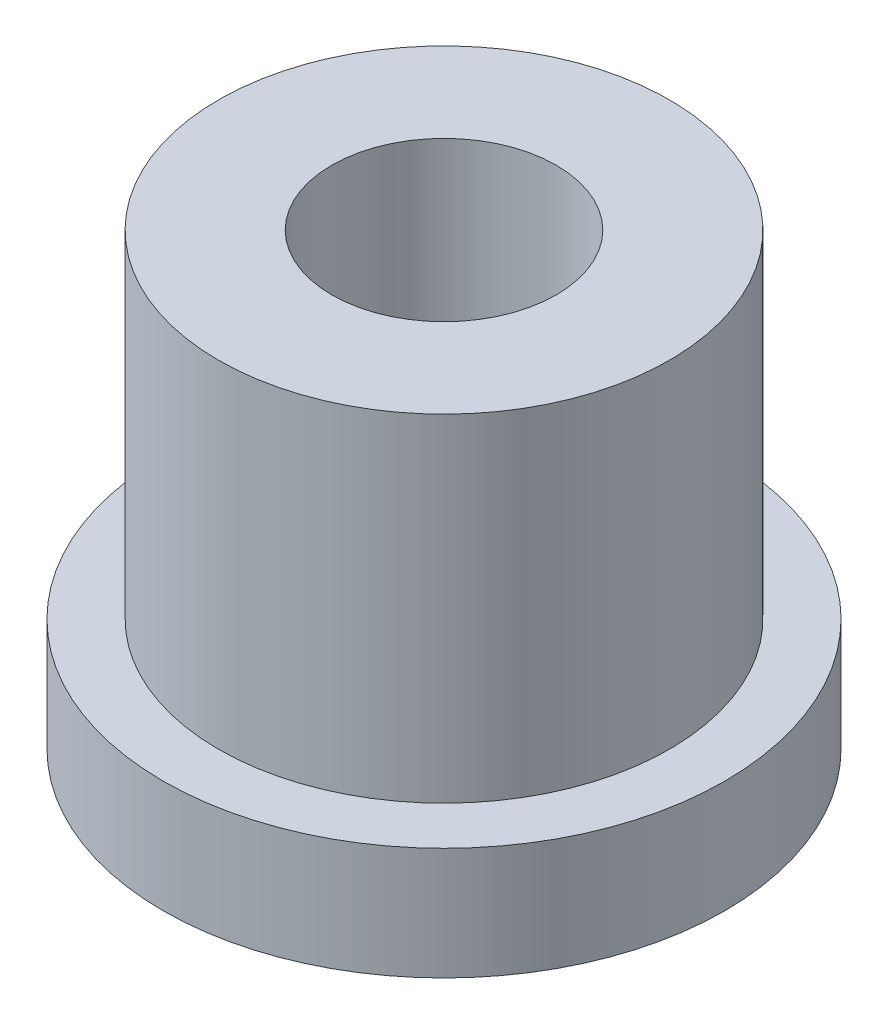
ISO-10303-21;
HEADER;
FILE_DESCRIPTION(('STEP AP214'),'2;1');
FILE_NAME('part.step','',(''),(''),'','','');
FILE_SCHEMA(('AUTOMOTIVE_DESIGN { 1 0 10303 214 1 1 1 1 }'));
ENDSEC;
DATA;
#1=APPLICATION_CONTEXT('core data for automotive mechanical design processes');
#2=APPLICATION_PROTOCOL_DEFINITION('international standard','automotive_design',2000,#1);
#3=PRODUCT_CONTEXT('',#1,'mechanical');
#4=PRODUCT('Part','Part','',(#3));
#5=PRODUCT_RELATED_PRODUCT_CATEGORY('part','',(#4));
#6=PRODUCT_DEFINITION_FORMATION('','',#4);
#7=PRODUCT_DEFINITION_CONTEXT('part definition',#1,'design');
#8=PRODUCT_DEFINITION('design','',#6,#7);
#9=PRODUCT_DEFINITION_SHAPE('','',#8);
#10=(LENGTH_UNIT() NAMED_UNIT(*) SI_UNIT(.MILLI.,.METRE.));
#11=(NAMED_UNIT(*) PLANE_ANGLE_UNIT() SI_UNIT($,.RADIAN.));
#12=(NAMED_UNIT(*) SI_UNIT($,.STERADIAN.) SOLID_ANGLE_UNIT());
#13=UNCERTAINTY_MEASURE_WITH_UNIT(LENGTH_MEASURE(1.E-05),#10,'distance_accuracy_value','');
#14=(GEOMETRIC_REPRESENTATION_CONTEXT(3) GLOBAL_UNCERTAINTY_ASSIGNED_CONTEXT((#13)) GLOBAL_UNIT_ASSIGNED_CONTEXT((#10,
#11,#12)) REPRESENTATION_CONTEXT('',''));
#15=CARTESIAN_POINT('',(0.,0.,0.));
#16=DIRECTION('',(0.,0.,1.));
#17=DIRECTION('',(1.,0.,0.));
#18=AXIS2_PLACEMENT_3D('',#15,#16,#17);
#19=CARTESIAN_POINT('',(0.,6.35,0.));
#20=DIRECTION('',(0.,1.,0.));
#21=DIRECTION('',(0.,0.,1.));
#22=AXIS2_PLACEMENT_3D('',#19,#20,#21);
#23=PLANE('',#22);
#24=CARTESIAN_POINT('',(0.,6.35,0.));
#25=DIRECTION('',(0.,1.,0.));
#26=DIRECTION('',(0.,0.,1.));
#27=AXIS2_PLACEMENT_3D('',#24,#25,#26);
#28=CIRCLE('',#27,3.1877);
#29=CARTESIAN_POINT('',(0.,6.35,3.1877));
#30=VERTEX_POINT('',#29);
#31=EDGE_CURVE('E10',#30,#30,#28,.T.);
#32=ORIENTED_EDGE('',*,*,#31,.T.);
#33=EDGE_LOOP('',(#32));
#34=FACE_BOUND('',#33,.T.);
#35=CARTESIAN_POINT('',(0.,6.35,0.));
#36=DIRECTION('',(0.,1.,0.));
#37=DIRECTION('',(0.,0.,1.));
#38=AXIS2_PLACEMENT_3D('',#35,#36,#37);
#39=CIRCLE('',#38,1.5875);
#40=CARTESIAN_POINT('',(0.,6.35,1.5875));
#41=VERTEX_POINT('',#40);
#42=EDGE_CURVE('E41',#41,#41,#39,.T.);
#43=ORIENTED_EDGE('',*,*,#42,.F.);
#44=EDGE_LOOP('',(#43));
#45=FACE_BOUND('',#44,.T.);
#46=ADVANCED_FACE('F34',(#34,#45),#23,.T.);
#47=CARTESIAN_POINT('',(0.,0.,0.));
#48=DIRECTION('',(0.,1.,0.));
#49=DIRECTION('',(0.,0.,1.));
#50=AXIS2_PLACEMENT_3D('',#47,#48,#49);
#51=PLANE('',#50);
#52=CARTESIAN_POINT('',(0.,0.,0.));
#53=DIRECTION('',(0.,1.,0.));
#54=DIRECTION('',(0.,0.,1.));
#55=AXIS2_PLACEMENT_3D('',#52,#53,#54);
#56=CIRCLE('',#55,1.5875);
#57=CARTESIAN_POINT('',(0.,0.,1.5875));
#58=VERTEX_POINT('',#57);
#59=EDGE_CURVE('E45',#58,#58,#56,.T.);
#60=ORIENTED_EDGE('',*,*,#59,.T.);
#61=EDGE_LOOP('',(#60));
#62=FACE_BOUND('',#61,.T.);
#63=CARTESIAN_POINT('',(0.,0.,0.));
#64=DIRECTION('',(0.,1.,0.));
#65=DIRECTION('',(0.,0.,1.));
#66=AXIS2_PLACEMENT_3D('',#63,#64,#65);
#67=CIRCLE('',#66,3.96875);
#68=CARTESIAN_POINT('',(0.,0.,3.96875));
#69=VERTEX_POINT('',#68);
#70=EDGE_CURVE('E52',#69,#69,#67,.T.);
#71=ORIENTED_EDGE('',*,*,#70,.F.);
#72=EDGE_LOOP('',(#71));
#73=FACE_BOUND('',#72,.T.);
#74=ADVANCED_FACE('F77',(#62,#73),#51,.F.);
#75=CARTESIAN_POINT('',(0.,6.35,0.));
#76=DIRECTION('',(0.,-1.,0.));
#77=DIRECTION('',(0.,0.,-1.));
#78=AXIS2_PLACEMENT_3D('',#75,#76,#77);
#79=CYLINDRICAL_SURFACE('',#78,3.1877);
#80=CARTESIAN_POINT('',(0.,1.5875,0.));
#81=DIRECTION('',(0.,1.,0.));
#82=DIRECTION('',(0.,0.,1.));
#83=AXIS2_PLACEMENT_3D('',#80,#81,#82);
#84=CIRCLE('',#83,3.1877);
#85=CARTESIAN_POINT('',(0.,1.5875,3.1877));
#86=VERTEX_POINT('',#85);
#87=EDGE_CURVE('E55',#86,#86,#84,.T.);
#88=ORIENTED_EDGE('',*,*,#87,.T.);
#89=EDGE_LOOP('',(#88));
#90=FACE_BOUND('',#89,.T.);
#91=ORIENTED_EDGE('',*,*,#31,.F.);
#92=EDGE_LOOP('',(#91));
#93=FACE_BOUND('',#92,.T.);
#94=ADVANCED_FACE('F36',(#90,#93),#79,.T.);
#95=CARTESIAN_POINT('',(0.,6.35,0.));
#96=DIRECTION('',(0.,-1.,0.));
#97=DIRECTION('',(0.,0.,-1.));
#98=AXIS2_PLACEMENT_3D('',#95,#96,#97);
#99=CYLINDRICAL_SURFACE('',#98,1.5875);
#100=ORIENTED_EDGE('',*,*,#42,.T.);
#101=EDGE_LOOP('',(#100));
#102=FACE_BOUND('',#101,.T.);
#103=ORIENTED_EDGE('',*,*,#59,.F.);
#104=EDGE_LOOP('',(#103));
#105=FACE_BOUND('',#104,.T.);
#106=ADVANCED_FACE('F66',(#102,#105),#99,.F.);
#107=CARTESIAN_POINT('',(0.,1.5875,0.));
#108=DIRECTION('',(0.,1.,0.));
#109=DIRECTION('',(0.,0.,1.));
#110=AXIS2_PLACEMENT_3D('',#107,#108,#109);
#111=PLANE('',#110);
#112=CARTESIAN_POINT('',(0.,1.5875,0.));
#113=DIRECTION('',(0.,1.,0.));
#114=DIRECTION('',(0.,0.,1.));
#115=AXIS2_PLACEMENT_3D('',#112,#113,#114);
#116=CIRCLE('',#115,3.96875);
#117=CARTESIAN_POINT('',(0.,1.5875,3.96875));
#118=VERTEX_POINT('',#117);
#119=EDGE_CURVE('E50',#118,#118,#116,.T.);
#120=ORIENTED_EDGE('',*,*,#119,.T.);
#121=EDGE_LOOP('',(#120));
#122=FACE_BOUND('',#121,.T.);
#123=ORIENTED_EDGE('',*,*,#87,.F.);
#124=EDGE_LOOP('',(#123));
#125=FACE_BOUND('',#124,.T.);
#126=ADVANCED_FACE('F63',(#122,#125),#111,.T.);
#127=CARTESIAN_POINT('',(0.,1.5875,0.));
#128=DIRECTION('',(0.,-1.,0.));
#129=DIRECTION('',(0.,0.,-1.));
#130=AXIS2_PLACEMENT_3D('',#127,#128,#129);
#131=CYLINDRICAL_SURFACE('',#130,3.96875);
#132=ORIENTED_EDGE('',*,*,#119,.F.);
#133=EDGE_LOOP('',(#132));
#134=FACE_BOUND('',#133,.T.);
#135=ORIENTED_EDGE('',*,*,#70,.T.);
#136=EDGE_LOOP('',(#135));
#137=FACE_BOUND('',#136,.T.);
#138=ADVANCED_FACE('F65',(#134,#137),#131,.T.);
#139=CLOSED_SHELL('',(#46,#74,#94,#106,#126,#138));
#140=MANIFOLD_SOLID_BREP('B2',#139);
#141=ADVANCED_BREP_SHAPE_REPRESENTATION('',(#18,#140),#14);
#142=SHAPE_DEFINITION_REPRESENTATION(#9,#141);
ENDSEC;
END-ISO-10303-21;
